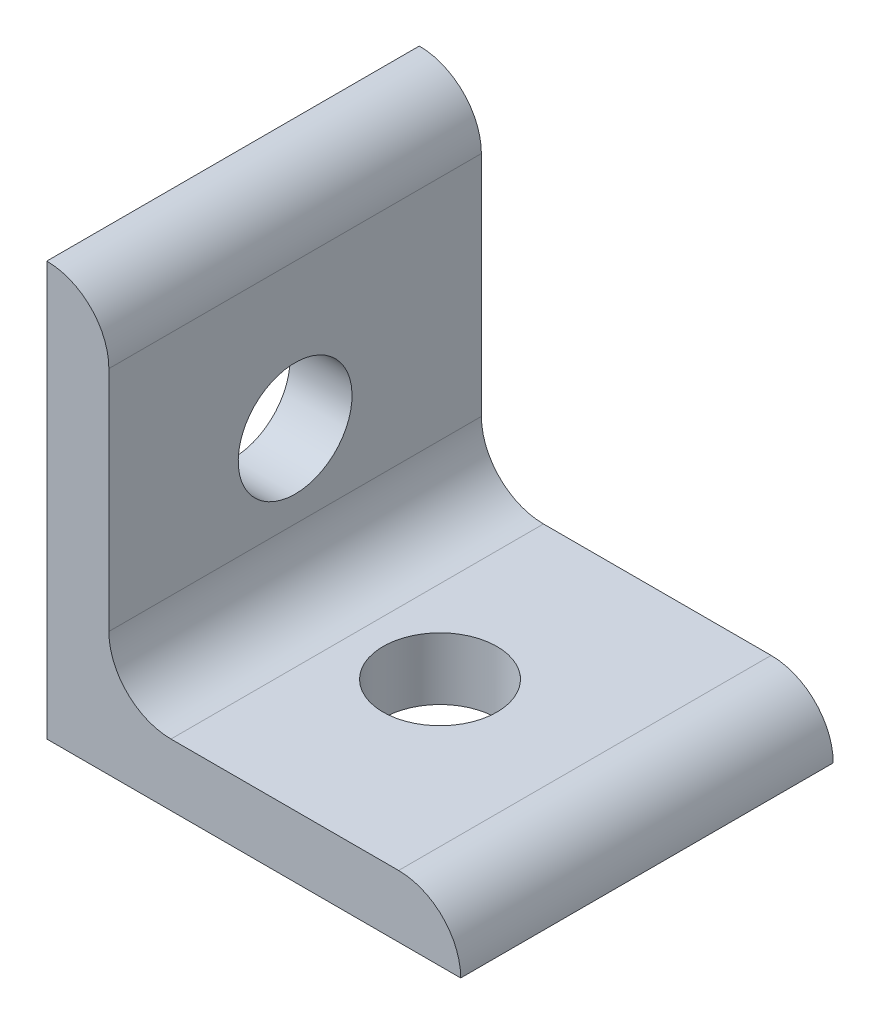
ISO-10303-21;
HEADER;
FILE_DESCRIPTION(('STEP AP214'),'2;1');
FILE_NAME('part.step','',(''),(''),'','','');
FILE_SCHEMA(('AUTOMOTIVE_DESIGN { 1 0 10303 214 1 1 1 1 }'));
ENDSEC;
DATA;
#1=APPLICATION_CONTEXT('core data for automotive mechanical design processes');
#2=APPLICATION_PROTOCOL_DEFINITION('international standard','automotive_design',2000,#1);
#3=PRODUCT_CONTEXT('',#1,'mechanical');
#4=PRODUCT('Part','Part','',(#3));
#5=PRODUCT_RELATED_PRODUCT_CATEGORY('part','',(#4));
#6=PRODUCT_DEFINITION_FORMATION('','',#4);
#7=PRODUCT_DEFINITION_CONTEXT('part definition',#1,'design');
#8=PRODUCT_DEFINITION('design','',#6,#7);
#9=PRODUCT_DEFINITION_SHAPE('','',#8);
#10=(LENGTH_UNIT() NAMED_UNIT(*) SI_UNIT(.MILLI.,.METRE.));
#11=(NAMED_UNIT(*) PLANE_ANGLE_UNIT() SI_UNIT($,.RADIAN.));
#12=(NAMED_UNIT(*) SI_UNIT($,.STERADIAN.) SOLID_ANGLE_UNIT());
#13=UNCERTAINTY_MEASURE_WITH_UNIT(LENGTH_MEASURE(1.E-05),#10,'distance_accuracy_value','');
#14=(GEOMETRIC_REPRESENTATION_CONTEXT(3) GLOBAL_UNCERTAINTY_ASSIGNED_CONTEXT((#13)) GLOBAL_UNIT_ASSIGNED_CONTEXT((#10,
#11,#12)) REPRESENTATION_CONTEXT('',''));
#15=CARTESIAN_POINT('',(0.,0.,0.));
#16=DIRECTION('',(0.,0.,1.));
#17=DIRECTION('',(1.,0.,0.));
#18=AXIS2_PLACEMENT_3D('',#15,#16,#17);
#19=CARTESIAN_POINT('',(3.,17.,9.));
#20=DIRECTION('',(-1.,0.,0.));
#21=DIRECTION('',(0.,-1.,0.));
#22=AXIS2_PLACEMENT_3D('',#19,#20,#21);
#23=PLANE('',#22);
#24=DIRECTION('',(0.,1.,0.));
#25=VECTOR('',#24,1.);
#26=CARTESIAN_POINT('',(3.,17.,-9.));
#27=LINE('',#26,#25);
#28=CARTESIAN_POINT('',(3.,6.,-9.));
#29=VERTEX_POINT('',#28);
#30=CARTESIAN_POINT('',(3.,17.,-9.));
#31=VERTEX_POINT('',#30);
#32=EDGE_CURVE('E116',#29,#31,#27,.T.);
#33=ORIENTED_EDGE('',*,*,#32,.T.);
#34=DIRECTION('',(0.,0.,-1.));
#35=VECTOR('',#34,1.);
#36=CARTESIAN_POINT('',(3.,17.,9.));
#37=LINE('',#36,#35);
#38=CARTESIAN_POINT('',(3.,17.,9.));
#39=VERTEX_POINT('',#38);
#40=EDGE_CURVE('E113',#39,#31,#37,.T.);
#41=ORIENTED_EDGE('',*,*,#40,.F.);
#42=DIRECTION('',(0.,1.,0.));
#43=VECTOR('',#42,1.);
#44=CARTESIAN_POINT('',(3.,17.,9.));
#45=LINE('',#44,#43);
#46=CARTESIAN_POINT('',(3.,6.,9.));
#47=VERTEX_POINT('',#46);
#48=EDGE_CURVE('E102',#47,#39,#45,.T.);
#49=ORIENTED_EDGE('',*,*,#48,.F.);
#50=DIRECTION('',(0.,0.,-1.));
#51=VECTOR('',#50,1.);
#52=CARTESIAN_POINT('',(3.,6.,9.));
#53=LINE('',#52,#51);
#54=EDGE_CURVE('E117',#47,#29,#53,.T.);
#55=ORIENTED_EDGE('',*,*,#54,.T.);
#56=EDGE_LOOP('',(#33,#41,#49,#55));
#57=FACE_BOUND('',#56,.T.);
#58=CARTESIAN_POINT('',(3.,10.,0.));
#59=DIRECTION('',(-1.,0.,0.));
#60=DIRECTION('',(0.,-1.,0.));
#61=AXIS2_PLACEMENT_3D('',#58,#59,#60);
#62=CIRCLE('',#61,2.75);
#63=CARTESIAN_POINT('',(3.,7.25000000000001,0.));
#64=VERTEX_POINT('',#63);
#65=EDGE_CURVE('E166',#64,#64,#62,.F.);
#66=ORIENTED_EDGE('',*,*,#65,.F.);
#67=EDGE_LOOP('',(#66));
#68=FACE_BOUND('',#67,.T.);
#69=ADVANCED_FACE('F34',(#57,#68),#23,.F.);
#70=CARTESIAN_POINT('',(0.,0.,9.));
#71=DIRECTION('',(1.,0.,0.));
#72=DIRECTION('',(0.,0.,-1.));
#73=AXIS2_PLACEMENT_3D('',#70,#71,#72);
#74=PLANE('',#73);
#75=DIRECTION('',(0.,-1.,0.));
#76=VECTOR('',#75,1.);
#77=CARTESIAN_POINT('',(0.,0.,-9.));
#78=LINE('',#77,#76);
#79=CARTESIAN_POINT('',(0.,20.,-9.));
#80=VERTEX_POINT('',#79);
#81=CARTESIAN_POINT('',(0.,0.,-9.));
#82=VERTEX_POINT('',#81);
#83=EDGE_CURVE('E84',#80,#82,#78,.T.);
#84=ORIENTED_EDGE('',*,*,#83,.T.);
#85=DIRECTION('',(0.,0.,-1.));
#86=VECTOR('',#85,1.);
#87=CARTESIAN_POINT('',(0.,0.,9.));
#88=LINE('',#87,#86);
#89=CARTESIAN_POINT('',(0.,0.,9.));
#90=VERTEX_POINT('',#89);
#91=EDGE_CURVE('E122',#90,#82,#88,.T.);
#92=ORIENTED_EDGE('',*,*,#91,.F.);
#93=DIRECTION('',(0.,-1.,0.));
#94=VECTOR('',#93,1.);
#95=CARTESIAN_POINT('',(0.,0.,9.));
#96=LINE('',#95,#94);
#97=CARTESIAN_POINT('',(0.,20.,9.));
#98=VERTEX_POINT('',#97);
#99=EDGE_CURVE('E52',#98,#90,#96,.T.);
#100=ORIENTED_EDGE('',*,*,#99,.F.);
#101=DIRECTION('',(0.,0.,-1.));
#102=VECTOR('',#101,1.);
#103=CARTESIAN_POINT('',(0.,20.,9.));
#104=LINE('',#103,#102);
#105=EDGE_CURVE('E118',#98,#80,#104,.T.);
#106=ORIENTED_EDGE('',*,*,#105,.T.);
#107=EDGE_LOOP('',(#84,#92,#100,#106));
#108=FACE_BOUND('',#107,.T.);
#109=CARTESIAN_POINT('',(0.,10.,0.));
#110=DIRECTION('',(1.,0.,0.));
#111=DIRECTION('',(0.,0.,-1.));
#112=AXIS2_PLACEMENT_3D('',#109,#110,#111);
#113=CIRCLE('',#112,2.75);
#114=CARTESIAN_POINT('',(0.,10.,-2.75));
#115=VERTEX_POINT('',#114);
#116=EDGE_CURVE('E169',#115,#115,#113,.T.);
#117=ORIENTED_EDGE('',*,*,#116,.T.);
#118=EDGE_LOOP('',(#117));
#119=FACE_BOUND('',#118,.T.);
#120=ADVANCED_FACE('F173',(#108,#119),#74,.F.);
#121=CARTESIAN_POINT('',(20.,0.,9.));
#122=DIRECTION('',(0.,1.,0.));
#123=DIRECTION('',(-1.,0.,0.));
#124=AXIS2_PLACEMENT_3D('',#121,#122,#123);
#125=PLANE('',#124);
#126=DIRECTION('',(1.,0.,0.));
#127=VECTOR('',#126,1.);
#128=CARTESIAN_POINT('',(20.,0.,-9.));
#129=LINE('',#128,#127);
#130=CARTESIAN_POINT('',(20.,0.,-9.));
#131=VERTEX_POINT('',#130);
#132=EDGE_CURVE('E126',#82,#131,#129,.T.);
#133=ORIENTED_EDGE('',*,*,#132,.T.);
#134=DIRECTION('',(0.,0.,-1.));
#135=VECTOR('',#134,1.);
#136=CARTESIAN_POINT('',(20.,0.,9.));
#137=LINE('',#136,#135);
#138=CARTESIAN_POINT('',(20.,0.,9.));
#139=VERTEX_POINT('',#138);
#140=EDGE_CURVE('E11',#139,#131,#137,.T.);
#141=ORIENTED_EDGE('',*,*,#140,.F.);
#142=DIRECTION('',(1.,0.,0.));
#143=VECTOR('',#142,1.);
#144=CARTESIAN_POINT('',(20.,0.,9.));
#145=LINE('',#144,#143);
#146=EDGE_CURVE('E138',#90,#139,#145,.T.);
#147=ORIENTED_EDGE('',*,*,#146,.F.);
#148=ORIENTED_EDGE('',*,*,#91,.T.);
#149=EDGE_LOOP('',(#133,#141,#147,#148));
#150=FACE_BOUND('',#149,.T.);
#151=CARTESIAN_POINT('',(10.,0.,0.));
#152=DIRECTION('',(0.,1.,0.));
#153=DIRECTION('',(0.,0.,1.));
#154=AXIS2_PLACEMENT_3D('',#151,#152,#153);
#155=CIRCLE('',#154,2.75);
#156=CARTESIAN_POINT('',(10.,0.,2.75));
#157=VERTEX_POINT('',#156);
#158=EDGE_CURVE('E163',#157,#157,#155,.T.);
#159=ORIENTED_EDGE('',*,*,#158,.T.);
#160=EDGE_LOOP('',(#159));
#161=FACE_BOUND('',#160,.T.);
#162=ADVANCED_FACE('F36',(#150,#161),#125,.F.);
#163=CARTESIAN_POINT('',(6.,3.,9.));
#164=DIRECTION('',(0.,-1.,0.));
#165=DIRECTION('',(1.,0.,0.));
#166=AXIS2_PLACEMENT_3D('',#163,#164,#165);
#167=PLANE('',#166);
#168=DIRECTION('',(-1.,0.,0.));
#169=VECTOR('',#168,1.);
#170=CARTESIAN_POINT('',(6.,3.,-9.));
#171=LINE('',#170,#169);
#172=CARTESIAN_POINT('',(17.,3.,-9.));
#173=VERTEX_POINT('',#172);
#174=CARTESIAN_POINT('',(6.,3.,-9.));
#175=VERTEX_POINT('',#174);
#176=EDGE_CURVE('E131',#173,#175,#171,.T.);
#177=ORIENTED_EDGE('',*,*,#176,.T.);
#178=DIRECTION('',(0.,0.,-1.));
#179=VECTOR('',#178,1.);
#180=CARTESIAN_POINT('',(6.,3.,9.));
#181=LINE('',#180,#179);
#182=CARTESIAN_POINT('',(6.,3.,9.));
#183=VERTEX_POINT('',#182);
#184=EDGE_CURVE('E142',#183,#175,#181,.T.);
#185=ORIENTED_EDGE('',*,*,#184,.F.);
#186=DIRECTION('',(-1.,0.,0.));
#187=VECTOR('',#186,1.);
#188=CARTESIAN_POINT('',(6.,3.,9.));
#189=LINE('',#188,#187);
#190=CARTESIAN_POINT('',(17.,3.,9.));
#191=VERTEX_POINT('',#190);
#192=EDGE_CURVE('E152',#191,#183,#189,.T.);
#193=ORIENTED_EDGE('',*,*,#192,.F.);
#194=DIRECTION('',(0.,0.,-1.));
#195=VECTOR('',#194,1.);
#196=CARTESIAN_POINT('',(17.,3.,9.));
#197=LINE('',#196,#195);
#198=EDGE_CURVE('E44',#191,#173,#197,.T.);
#199=ORIENTED_EDGE('',*,*,#198,.T.);
#200=EDGE_LOOP('',(#177,#185,#193,#199));
#201=FACE_BOUND('',#200,.T.);
#202=CARTESIAN_POINT('',(10.,3.,0.));
#203=DIRECTION('',(0.,-1.,0.));
#204=DIRECTION('',(1.,0.,0.));
#205=AXIS2_PLACEMENT_3D('',#202,#203,#204);
#206=CIRCLE('',#205,2.75);
#207=CARTESIAN_POINT('',(12.75,3.,0.));
#208=VERTEX_POINT('',#207);
#209=EDGE_CURVE('E38',#208,#208,#206,.F.);
#210=ORIENTED_EDGE('',*,*,#209,.F.);
#211=EDGE_LOOP('',(#210));
#212=FACE_BOUND('',#211,.T.);
#213=ADVANCED_FACE('F149',(#201,#212),#167,.F.);
#214=CARTESIAN_POINT('',(17.,0.,9.));
#215=DIRECTION('',(0.,0.,-1.));
#216=DIRECTION('',(-1.,0.,0.));
#217=AXIS2_PLACEMENT_3D('',#214,#215,#216);
#218=CYLINDRICAL_SURFACE('',#217,3.);
#219=CARTESIAN_POINT('',(17.,0.,-9.));
#220=DIRECTION('',(0.,0.,1.));
#221=DIRECTION('',(1.,0.,0.));
#222=AXIS2_PLACEMENT_3D('',#219,#220,#221);
#223=CIRCLE('',#222,3.);
#224=EDGE_CURVE('E129',#131,#173,#223,.T.);
#225=ORIENTED_EDGE('',*,*,#224,.T.);
#226=ORIENTED_EDGE('',*,*,#198,.F.);
#227=CARTESIAN_POINT('',(17.,0.,9.));
#228=DIRECTION('',(0.,0.,1.));
#229=DIRECTION('',(1.,0.,0.));
#230=AXIS2_PLACEMENT_3D('',#227,#228,#229);
#231=CIRCLE('',#230,3.);
#232=EDGE_CURVE('E92',#139,#191,#231,.T.);
#233=ORIENTED_EDGE('',*,*,#232,.F.);
#234=ORIENTED_EDGE('',*,*,#140,.T.);
#235=EDGE_LOOP('',(#225,#226,#233,#234));
#236=FACE_BOUND('',#235,.T.);
#237=ADVANCED_FACE('F191',(#236),#218,.T.);
#238=CARTESIAN_POINT('',(6.,6.,9.));
#239=DIRECTION('',(0.,0.,-1.));
#240=DIRECTION('',(-1.,0.,0.));
#241=AXIS2_PLACEMENT_3D('',#238,#239,#240);
#242=CYLINDRICAL_SURFACE('',#241,3.);
#243=CARTESIAN_POINT('',(6.,6.,-9.));
#244=DIRECTION('',(0.,0.,-1.));
#245=DIRECTION('',(1.,0.,0.));
#246=AXIS2_PLACEMENT_3D('',#243,#244,#245);
#247=CIRCLE('',#246,3.);
#248=EDGE_CURVE('E133',#175,#29,#247,.T.);
#249=ORIENTED_EDGE('',*,*,#248,.T.);
#250=ORIENTED_EDGE('',*,*,#54,.F.);
#251=CARTESIAN_POINT('',(6.,6.,9.));
#252=DIRECTION('',(0.,0.,-1.));
#253=DIRECTION('',(1.,0.,0.));
#254=AXIS2_PLACEMENT_3D('',#251,#252,#253);
#255=CIRCLE('',#254,3.);
#256=EDGE_CURVE('E108',#183,#47,#255,.T.);
#257=ORIENTED_EDGE('',*,*,#256,.F.);
#258=ORIENTED_EDGE('',*,*,#184,.T.);
#259=EDGE_LOOP('',(#249,#250,#257,#258));
#260=FACE_BOUND('',#259,.T.);
#261=ADVANCED_FACE('F158',(#260),#242,.F.);
#262=CARTESIAN_POINT('',(0.,17.,9.));
#263=DIRECTION('',(0.,0.,-1.));
#264=DIRECTION('',(-1.,0.,0.));
#265=AXIS2_PLACEMENT_3D('',#262,#263,#264);
#266=CYLINDRICAL_SURFACE('',#265,3.);
#267=CARTESIAN_POINT('',(0.,17.,-9.));
#268=DIRECTION('',(0.,0.,1.));
#269=DIRECTION('',(1.,0.,0.));
#270=AXIS2_PLACEMENT_3D('',#267,#268,#269);
#271=CIRCLE('',#270,3.);
#272=EDGE_CURVE('E78',#31,#80,#271,.T.);
#273=ORIENTED_EDGE('',*,*,#272,.T.);
#274=ORIENTED_EDGE('',*,*,#105,.F.);
#275=CARTESIAN_POINT('',(0.,17.,9.));
#276=DIRECTION('',(0.,0.,1.));
#277=DIRECTION('',(1.,0.,0.));
#278=AXIS2_PLACEMENT_3D('',#275,#276,#277);
#279=CIRCLE('',#278,3.);
#280=EDGE_CURVE('E106',#39,#98,#279,.T.);
#281=ORIENTED_EDGE('',*,*,#280,.F.);
#282=ORIENTED_EDGE('',*,*,#40,.T.);
#283=EDGE_LOOP('',(#273,#274,#281,#282));
#284=FACE_BOUND('',#283,.T.);
#285=ADVANCED_FACE('F120',(#284),#266,.T.);
#286=CARTESIAN_POINT('',(0.,17.,9.));
#287=DIRECTION('',(0.,0.,1.));
#288=DIRECTION('',(1.,0.,0.));
#289=AXIS2_PLACEMENT_3D('',#286,#287,#288);
#290=PLANE('',#289);
#291=ORIENTED_EDGE('',*,*,#146,.T.);
#292=ORIENTED_EDGE('',*,*,#232,.T.);
#293=ORIENTED_EDGE('',*,*,#192,.T.);
#294=ORIENTED_EDGE('',*,*,#256,.T.);
#295=ORIENTED_EDGE('',*,*,#48,.T.);
#296=ORIENTED_EDGE('',*,*,#280,.T.);
#297=ORIENTED_EDGE('',*,*,#99,.T.);
#298=EDGE_LOOP('',(#291,#292,#293,#294,#295,#296,#297));
#299=FACE_BOUND('',#298,.T.);
#300=ADVANCED_FACE('F104',(#299),#290,.T.);
#301=CARTESIAN_POINT('',(0.,17.,-9.));
#302=DIRECTION('',(0.,0.,1.));
#303=DIRECTION('',(1.,0.,0.));
#304=AXIS2_PLACEMENT_3D('',#301,#302,#303);
#305=PLANE('',#304);
#306=ORIENTED_EDGE('',*,*,#132,.F.);
#307=ORIENTED_EDGE('',*,*,#83,.F.);
#308=ORIENTED_EDGE('',*,*,#272,.F.);
#309=ORIENTED_EDGE('',*,*,#32,.F.);
#310=ORIENTED_EDGE('',*,*,#248,.F.);
#311=ORIENTED_EDGE('',*,*,#176,.F.);
#312=ORIENTED_EDGE('',*,*,#224,.F.);
#313=EDGE_LOOP('',(#306,#307,#308,#309,#310,#311,#312));
#314=FACE_BOUND('',#313,.T.);
#315=ADVANCED_FACE('F156',(#314),#305,.F.);
#316=CARTESIAN_POINT('',(10.,20.,0.));
#317=DIRECTION('',(0.,-1.,0.));
#318=DIRECTION('',(0.,0.,-1.));
#319=AXIS2_PLACEMENT_3D('',#316,#317,#318);
#320=CYLINDRICAL_SURFACE('',#319,2.75);
#321=ORIENTED_EDGE('',*,*,#158,.F.);
#322=EDGE_LOOP('',(#321));
#323=FACE_BOUND('',#322,.T.);
#324=ORIENTED_EDGE('',*,*,#209,.T.);
#325=EDGE_LOOP('',(#324));
#326=FACE_BOUND('',#325,.T.);
#327=ADVANCED_FACE('F178',(#323,#326),#320,.F.);
#328=CARTESIAN_POINT('',(20.,10.,0.));
#329=DIRECTION('',(-1.,0.,0.));
#330=DIRECTION('',(0.,0.,1.));
#331=AXIS2_PLACEMENT_3D('',#328,#329,#330);
#332=CYLINDRICAL_SURFACE('',#331,2.75);
#333=ORIENTED_EDGE('',*,*,#116,.F.);
#334=EDGE_LOOP('',(#333));
#335=FACE_BOUND('',#334,.T.);
#336=ORIENTED_EDGE('',*,*,#65,.T.);
#337=EDGE_LOOP('',(#336));
#338=FACE_BOUND('',#337,.T.);
#339=ADVANCED_FACE('F175',(#335,#338),#332,.F.);
#340=CLOSED_SHELL('',(#69,#120,#162,#213,#237,#261,#285,#300,#315,#327,#339));
#341=MANIFOLD_SOLID_BREP('B2',#340);
#342=ADVANCED_BREP_SHAPE_REPRESENTATION('',(#18,#341),#14);
#343=SHAPE_DEFINITION_REPRESENTATION(#9,#342);
ENDSEC;
END-ISO-10303-21;
